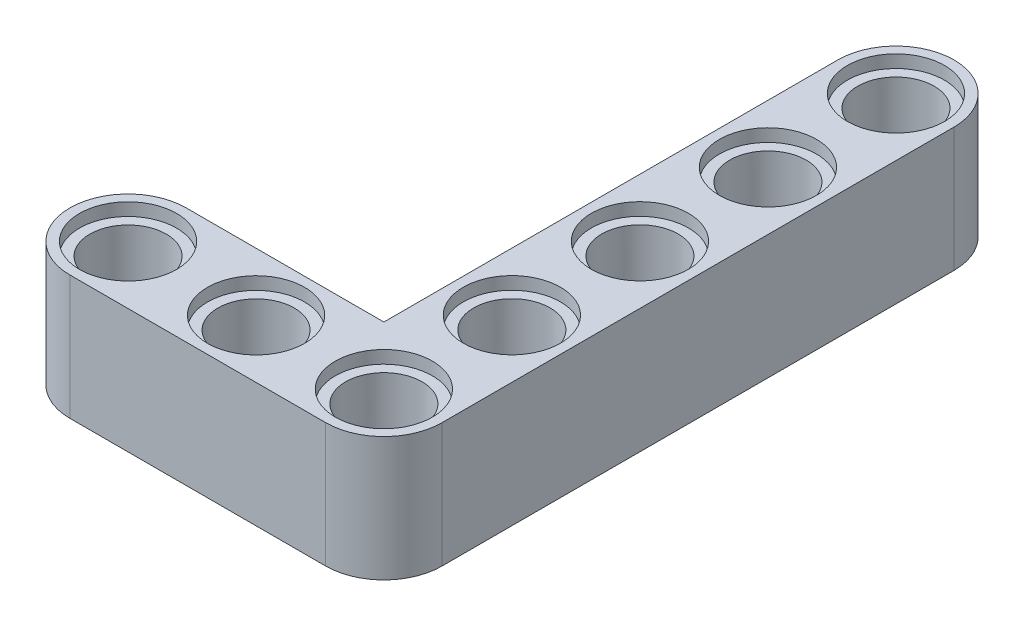
ISO-10303-21;
HEADER;
FILE_DESCRIPTION(('STEP AP214'),'2;1');
FILE_NAME('part.step','',(''),(''),'','','');
FILE_SCHEMA(('AUTOMOTIVE_DESIGN { 1 0 10303 214 1 1 1 1 }'));
ENDSEC;
DATA;
#1=APPLICATION_CONTEXT('core data for automotive mechanical design processes');
#2=APPLICATION_PROTOCOL_DEFINITION('international standard','automotive_design',2000,#1);
#3=PRODUCT_CONTEXT('',#1,'mechanical');
#4=PRODUCT('Part','Part','',(#3));
#5=PRODUCT_RELATED_PRODUCT_CATEGORY('part','',(#4));
#6=PRODUCT_DEFINITION_FORMATION('','',#4);
#7=PRODUCT_DEFINITION_CONTEXT('part definition',#1,'design');
#8=PRODUCT_DEFINITION('design','',#6,#7);
#9=PRODUCT_DEFINITION_SHAPE('','',#8);
#10=(LENGTH_UNIT() NAMED_UNIT(*) SI_UNIT(.MILLI.,.METRE.));
#11=(NAMED_UNIT(*) PLANE_ANGLE_UNIT() SI_UNIT($,.RADIAN.));
#12=(NAMED_UNIT(*) SI_UNIT($,.STERADIAN.) SOLID_ANGLE_UNIT());
#13=UNCERTAINTY_MEASURE_WITH_UNIT(LENGTH_MEASURE(1.E-05),#10,'distance_accuracy_value','');
#14=(GEOMETRIC_REPRESENTATION_CONTEXT(3) GLOBAL_UNCERTAINTY_ASSIGNED_CONTEXT((#13)) GLOBAL_UNIT_ASSIGNED_CONTEXT((#10,
#11,#12)) REPRESENTATION_CONTEXT('',''));
#15=CARTESIAN_POINT('',(0.,0.,0.));
#16=DIRECTION('',(0.,0.,1.));
#17=DIRECTION('',(1.,0.,0.));
#18=AXIS2_PLACEMENT_3D('',#15,#16,#17);
#19=CARTESIAN_POINT('',(-39.0124274848828,7.8,18.5405550831444));
#20=DIRECTION('',(0.,-1.,0.));
#21=DIRECTION('',(0.,0.,-1.));
#22=AXIS2_PLACEMENT_3D('',#19,#20,#21);
#23=CYLINDRICAL_SURFACE('',#22,2.4);
#24=CARTESIAN_POINT('',(-39.0124274848828,7.,18.5405550831444));
#25=DIRECTION('',(0.,1.,0.));
#26=DIRECTION('',(0.,0.,1.));
#27=AXIS2_PLACEMENT_3D('',#24,#25,#26);
#28=CIRCLE('',#27,2.4);
#29=CARTESIAN_POINT('',(-39.0124274848828,7.,20.9405550831444));
#30=VERTEX_POINT('',#29);
#31=EDGE_CURVE('E130',#30,#30,#28,.T.);
#32=ORIENTED_EDGE('',*,*,#31,.T.);
#33=EDGE_LOOP('',(#32));
#34=FACE_BOUND('',#33,.T.);
#35=CARTESIAN_POINT('',(-39.0124274848828,0.8,18.5405550831444));
#36=DIRECTION('',(0.,-1.,0.));
#37=DIRECTION('',(0.,0.,-1.));
#38=AXIS2_PLACEMENT_3D('',#35,#36,#37);
#39=CIRCLE('',#38,2.4);
#40=CARTESIAN_POINT('',(-39.0124274848828,0.8,16.1405550831444));
#41=VERTEX_POINT('',#40);
#42=EDGE_CURVE('E37',#41,#41,#39,.T.);
#43=ORIENTED_EDGE('',*,*,#42,.T.);
#44=EDGE_LOOP('',(#43));
#45=FACE_BOUND('',#44,.T.);
#46=ADVANCED_FACE('F33',(#34,#45),#23,.F.);
#47=CARTESIAN_POINT('',(-30.9724274848828,7.8,18.5405550831444));
#48=DIRECTION('',(0.,-1.,0.));
#49=DIRECTION('',(0.,0.,-1.));
#50=AXIS2_PLACEMENT_3D('',#47,#48,#49);
#51=CYLINDRICAL_SURFACE('',#50,2.4);
#52=CARTESIAN_POINT('',(-30.9724274848828,7.,18.5405550831444));
#53=DIRECTION('',(0.,1.,0.));
#54=DIRECTION('',(0.,0.,1.));
#55=AXIS2_PLACEMENT_3D('',#52,#53,#54);
#56=CIRCLE('',#55,2.4);
#57=CARTESIAN_POINT('',(-30.9724274848828,7.,20.9405550831444));
#58=VERTEX_POINT('',#57);
#59=EDGE_CURVE('E164',#58,#58,#56,.T.);
#60=ORIENTED_EDGE('',*,*,#59,.T.);
#61=EDGE_LOOP('',(#60));
#62=FACE_BOUND('',#61,.T.);
#63=CARTESIAN_POINT('',(-30.9724274848828,0.8,18.5405550831444));
#64=DIRECTION('',(0.,-1.,0.));
#65=DIRECTION('',(0.,0.,-1.));
#66=AXIS2_PLACEMENT_3D('',#63,#64,#65);
#67=CIRCLE('',#66,2.4);
#68=CARTESIAN_POINT('',(-30.9724274848828,0.8,16.1405550831444));
#69=VERTEX_POINT('',#68);
#70=EDGE_CURVE('E184',#69,#69,#67,.T.);
#71=ORIENTED_EDGE('',*,*,#70,.T.);
#72=EDGE_LOOP('',(#71));
#73=FACE_BOUND('',#72,.T.);
#74=ADVANCED_FACE('F233',(#62,#73),#51,.F.);
#75=CARTESIAN_POINT('',(-22.9464753406226,7.8,18.5405550831444));
#76=DIRECTION('',(0.,-1.,0.));
#77=DIRECTION('',(0.,0.,-1.));
#78=AXIS2_PLACEMENT_3D('',#75,#76,#77);
#79=CYLINDRICAL_SURFACE('',#78,2.4);
#80=CARTESIAN_POINT('',(-22.9464753406226,7.,18.5405550831444));
#81=DIRECTION('',(0.,1.,0.));
#82=DIRECTION('',(0.,0.,1.));
#83=AXIS2_PLACEMENT_3D('',#80,#81,#82);
#84=CIRCLE('',#83,2.4);
#85=CARTESIAN_POINT('',(-22.9464753406226,7.,20.9405550831444));
#86=VERTEX_POINT('',#85);
#87=EDGE_CURVE('E161',#86,#86,#84,.T.);
#88=ORIENTED_EDGE('',*,*,#87,.T.);
#89=EDGE_LOOP('',(#88));
#90=FACE_BOUND('',#89,.T.);
#91=CARTESIAN_POINT('',(-22.9464753406226,0.8,18.5405550831444));
#92=DIRECTION('',(0.,-1.,0.));
#93=DIRECTION('',(0.,0.,-1.));
#94=AXIS2_PLACEMENT_3D('',#91,#92,#93);
#95=CIRCLE('',#94,2.4);
#96=CARTESIAN_POINT('',(-22.9464753406226,0.8,16.1405550831444));
#97=VERTEX_POINT('',#96);
#98=EDGE_CURVE('E182',#97,#97,#95,.T.);
#99=ORIENTED_EDGE('',*,*,#98,.T.);
#100=EDGE_LOOP('',(#99));
#101=FACE_BOUND('',#100,.T.);
#102=ADVANCED_FACE('F239',(#90,#101),#79,.F.);
#103=CARTESIAN_POINT('',(-22.9464753406226,7.8,-5.57944491685563));
#104=DIRECTION('',(0.,-1.,0.));
#105=DIRECTION('',(0.,0.,-1.));
#106=AXIS2_PLACEMENT_3D('',#103,#104,#105);
#107=CYLINDRICAL_SURFACE('',#106,2.4);
#108=CARTESIAN_POINT('',(-22.9464753406226,7.,-5.57944491685563));
#109=DIRECTION('',(0.,1.,0.));
#110=DIRECTION('',(0.,0.,1.));
#111=AXIS2_PLACEMENT_3D('',#108,#109,#110);
#112=CIRCLE('',#111,2.4);
#113=CARTESIAN_POINT('',(-22.9464753406226,7.,-3.17944491685563));
#114=VERTEX_POINT('',#113);
#115=EDGE_CURVE('E158',#114,#114,#112,.T.);
#116=ORIENTED_EDGE('',*,*,#115,.T.);
#117=EDGE_LOOP('',(#116));
#118=FACE_BOUND('',#117,.T.);
#119=CARTESIAN_POINT('',(-22.9464753406226,0.8,-5.57944491685563));
#120=DIRECTION('',(0.,-1.,0.));
#121=DIRECTION('',(0.,0.,-1.));
#122=AXIS2_PLACEMENT_3D('',#119,#120,#121);
#123=CIRCLE('',#122,2.4);
#124=CARTESIAN_POINT('',(-22.9464753406226,0.8,-7.97944491685563));
#125=VERTEX_POINT('',#124);
#126=EDGE_CURVE('E179',#125,#125,#123,.T.);
#127=ORIENTED_EDGE('',*,*,#126,.T.);
#128=EDGE_LOOP('',(#127));
#129=FACE_BOUND('',#128,.T.);
#130=ADVANCED_FACE('F362',(#118,#129),#107,.F.);
#131=CARTESIAN_POINT('',(-22.9464753406226,7.8,2.46055508314437));
#132=DIRECTION('',(0.,-1.,0.));
#133=DIRECTION('',(0.,0.,-1.));
#134=AXIS2_PLACEMENT_3D('',#131,#132,#133);
#135=CYLINDRICAL_SURFACE('',#134,2.4);
#136=CARTESIAN_POINT('',(-22.9464753406226,7.,2.46055508314437));
#137=DIRECTION('',(0.,1.,0.));
#138=DIRECTION('',(0.,0.,1.));
#139=AXIS2_PLACEMENT_3D('',#136,#137,#138);
#140=CIRCLE('',#139,2.4);
#141=CARTESIAN_POINT('',(-22.9464753406226,7.,4.86055508314437));
#142=VERTEX_POINT('',#141);
#143=EDGE_CURVE('E155',#142,#142,#140,.T.);
#144=ORIENTED_EDGE('',*,*,#143,.T.);
#145=EDGE_LOOP('',(#144));
#146=FACE_BOUND('',#145,.T.);
#147=CARTESIAN_POINT('',(-22.9464753406226,0.8,2.46055508314437));
#148=DIRECTION('',(0.,-1.,0.));
#149=DIRECTION('',(0.,0.,-1.));
#150=AXIS2_PLACEMENT_3D('',#147,#148,#149);
#151=CIRCLE('',#150,2.4);
#152=CARTESIAN_POINT('',(-22.9464753406226,0.8,0.0605550831443689));
#153=VERTEX_POINT('',#152);
#154=EDGE_CURVE('E176',#153,#153,#151,.T.);
#155=ORIENTED_EDGE('',*,*,#154,.T.);
#156=EDGE_LOOP('',(#155));
#157=FACE_BOUND('',#156,.T.);
#158=ADVANCED_FACE('F358',(#146,#157),#135,.F.);
#159=CARTESIAN_POINT('',(-22.9464753406226,7.8,-13.6194449168556));
#160=DIRECTION('',(0.,-1.,0.));
#161=DIRECTION('',(0.,0.,-1.));
#162=AXIS2_PLACEMENT_3D('',#159,#160,#161);
#163=CYLINDRICAL_SURFACE('',#162,2.4);
#164=CARTESIAN_POINT('',(-22.9464753406226,7.,-13.6194449168556));
#165=DIRECTION('',(0.,1.,0.));
#166=DIRECTION('',(0.,0.,1.));
#167=AXIS2_PLACEMENT_3D('',#164,#165,#166);
#168=CIRCLE('',#167,2.4);
#169=CARTESIAN_POINT('',(-22.9464753406226,7.,-11.2194449168556));
#170=VERTEX_POINT('',#169);
#171=EDGE_CURVE('E151',#170,#170,#168,.T.);
#172=ORIENTED_EDGE('',*,*,#171,.T.);
#173=EDGE_LOOP('',(#172));
#174=FACE_BOUND('',#173,.T.);
#175=CARTESIAN_POINT('',(-22.9464753406226,0.8,-13.6194449168556));
#176=DIRECTION('',(0.,-1.,0.));
#177=DIRECTION('',(0.,0.,-1.));
#178=AXIS2_PLACEMENT_3D('',#175,#176,#177);
#179=CIRCLE('',#178,2.4);
#180=CARTESIAN_POINT('',(-22.9464753406226,0.8,-16.0194449168556));
#181=VERTEX_POINT('',#180);
#182=EDGE_CURVE('E172',#181,#181,#179,.T.);
#183=ORIENTED_EDGE('',*,*,#182,.T.);
#184=EDGE_LOOP('',(#183));
#185=FACE_BOUND('',#184,.T.);
#186=ADVANCED_FACE('F354',(#174,#185),#163,.F.);
#187=CARTESIAN_POINT('',(-22.9464753406226,7.8,10.5005550831444));
#188=DIRECTION('',(0.,-1.,0.));
#189=DIRECTION('',(0.,0.,-1.));
#190=AXIS2_PLACEMENT_3D('',#187,#188,#189);
#191=CYLINDRICAL_SURFACE('',#190,2.4);
#192=CARTESIAN_POINT('',(-22.9464753406226,7.,10.5005550831444));
#193=DIRECTION('',(0.,1.,0.));
#194=DIRECTION('',(0.,0.,1.));
#195=AXIS2_PLACEMENT_3D('',#192,#193,#194);
#196=CIRCLE('',#195,2.4);
#197=CARTESIAN_POINT('',(-22.9464753406226,7.,12.9005550831444));
#198=VERTEX_POINT('',#197);
#199=EDGE_CURVE('E148',#198,#198,#196,.T.);
#200=ORIENTED_EDGE('',*,*,#199,.T.);
#201=EDGE_LOOP('',(#200));
#202=FACE_BOUND('',#201,.T.);
#203=CARTESIAN_POINT('',(-22.9464753406226,0.8,10.5005550831444));
#204=DIRECTION('',(0.,-1.,0.));
#205=DIRECTION('',(0.,0.,-1.));
#206=AXIS2_PLACEMENT_3D('',#203,#204,#205);
#207=CIRCLE('',#206,2.4);
#208=CARTESIAN_POINT('',(-22.9464753406226,0.8,8.10055508314437));
#209=VERTEX_POINT('',#208);
#210=EDGE_CURVE('E169',#209,#209,#207,.T.);
#211=ORIENTED_EDGE('',*,*,#210,.T.);
#212=EDGE_LOOP('',(#211));
#213=FACE_BOUND('',#212,.T.);
#214=ADVANCED_FACE('F245',(#202,#213),#191,.F.);
#215=CARTESIAN_POINT('',(-39.0124274848828,7.8,18.5405550831444));
#216=DIRECTION('',(0.,1.,0.));
#217=DIRECTION('',(0.,0.,1.));
#218=AXIS2_PLACEMENT_3D('',#215,#216,#217);
#219=PLANE('',#218);
#220=CARTESIAN_POINT('',(-39.0124274848828,7.8,18.5405550831444));
#221=DIRECTION('',(0.,1.,0.));
#222=DIRECTION('',(0.,0.,1.));
#223=AXIS2_PLACEMENT_3D('',#220,#221,#222);
#224=CIRCLE('',#223,3.05);
#225=CARTESIAN_POINT('',(-39.0124274848828,7.8,21.5905550831444));
#226=VERTEX_POINT('',#225);
#227=EDGE_CURVE('E291',#226,#226,#224,.T.);
#228=ORIENTED_EDGE('',*,*,#227,.F.);
#229=EDGE_LOOP('',(#228));
#230=FACE_BOUND('',#229,.T.);
#231=CARTESIAN_POINT('',(-30.9724274848828,7.8,18.5405550831444));
#232=DIRECTION('',(0.,1.,0.));
#233=DIRECTION('',(0.,0.,1.));
#234=AXIS2_PLACEMENT_3D('',#231,#232,#233);
#235=CIRCLE('',#234,3.05);
#236=CARTESIAN_POINT('',(-30.9724274848828,7.8,21.5905550831444));
#237=VERTEX_POINT('',#236);
#238=EDGE_CURVE('E297',#237,#237,#235,.T.);
#239=ORIENTED_EDGE('',*,*,#238,.F.);
#240=EDGE_LOOP('',(#239));
#241=FACE_BOUND('',#240,.T.);
#242=CARTESIAN_POINT('',(-22.9464753406226,7.8,18.5405550831444));
#243=DIRECTION('',(0.,1.,0.));
#244=DIRECTION('',(0.,0.,1.));
#245=AXIS2_PLACEMENT_3D('',#242,#243,#244);
#246=CIRCLE('',#245,3.05);
#247=CARTESIAN_POINT('',(-22.9464753406226,7.8,21.5905550831444));
#248=VERTEX_POINT('',#247);
#249=EDGE_CURVE('E303',#248,#248,#246,.T.);
#250=ORIENTED_EDGE('',*,*,#249,.F.);
#251=EDGE_LOOP('',(#250));
#252=FACE_BOUND('',#251,.T.);
#253=CARTESIAN_POINT('',(-22.9464753406226,7.8,10.5005550831444));
#254=DIRECTION('',(0.,1.,0.));
#255=DIRECTION('',(0.,0.,1.));
#256=AXIS2_PLACEMENT_3D('',#253,#254,#255);
#257=CIRCLE('',#256,3.05);
#258=CARTESIAN_POINT('',(-22.9464753406226,7.8,13.5505550831444));
#259=VERTEX_POINT('',#258);
#260=EDGE_CURVE('E309',#259,#259,#257,.T.);
#261=ORIENTED_EDGE('',*,*,#260,.F.);
#262=EDGE_LOOP('',(#261));
#263=FACE_BOUND('',#262,.T.);
#264=CARTESIAN_POINT('',(-22.9464753406226,7.8,2.46055508314437));
#265=DIRECTION('',(0.,1.,0.));
#266=DIRECTION('',(0.,0.,1.));
#267=AXIS2_PLACEMENT_3D('',#264,#265,#266);
#268=CIRCLE('',#267,3.05);
#269=CARTESIAN_POINT('',(-22.9464753406226,7.8,5.51055508314437));
#270=VERTEX_POINT('',#269);
#271=EDGE_CURVE('E315',#270,#270,#268,.T.);
#272=ORIENTED_EDGE('',*,*,#271,.F.);
#273=EDGE_LOOP('',(#272));
#274=FACE_BOUND('',#273,.T.);
#275=CARTESIAN_POINT('',(-22.9464753406226,7.8,-5.57944491685563));
#276=DIRECTION('',(0.,1.,0.));
#277=DIRECTION('',(0.,0.,1.));
#278=AXIS2_PLACEMENT_3D('',#275,#276,#277);
#279=CIRCLE('',#278,3.05);
#280=CARTESIAN_POINT('',(-22.9464753406226,7.8,-2.52944491685563));
#281=VERTEX_POINT('',#280);
#282=EDGE_CURVE('E198',#281,#281,#279,.T.);
#283=ORIENTED_EDGE('',*,*,#282,.F.);
#284=EDGE_LOOP('',(#283));
#285=FACE_BOUND('',#284,.T.);
#286=CARTESIAN_POINT('',(-22.9464753406226,7.8,-13.6194449168556));
#287=DIRECTION('',(0.,1.,0.));
#288=DIRECTION('',(0.,0.,1.));
#289=AXIS2_PLACEMENT_3D('',#286,#287,#288);
#290=CIRCLE('',#289,3.05);
#291=CARTESIAN_POINT('',(-22.9464753406226,7.8,-10.5694449168556));
#292=VERTEX_POINT('',#291);
#293=EDGE_CURVE('E189',#292,#292,#290,.T.);
#294=ORIENTED_EDGE('',*,*,#293,.F.);
#295=EDGE_LOOP('',(#294));
#296=FACE_BOUND('',#295,.T.);
#297=CARTESIAN_POINT('',(-39.0124274848828,7.8,18.5405550831444));
#298=DIRECTION('',(0.,1.,0.));
#299=DIRECTION('',(0.,0.,1.));
#300=AXIS2_PLACEMENT_3D('',#297,#298,#299);
#301=CIRCLE('',#300,3.65);
#302=CARTESIAN_POINT('',(-39.0124274848828,7.8,14.8905550831444));
#303=VERTEX_POINT('',#302);
#304=CARTESIAN_POINT('',(-39.0124274848828,7.8,22.1905550831444));
#305=VERTEX_POINT('',#304);
#306=EDGE_CURVE('E139',#303,#305,#301,.T.);
#307=ORIENTED_EDGE('',*,*,#306,.T.);
#308=DIRECTION('',(1.,0.,0.));
#309=VECTOR('',#308,1.);
#310=CARTESIAN_POINT('',(-39.0124274848828,7.8,22.1905550831444));
#311=LINE('',#310,#309);
#312=CARTESIAN_POINT('',(-22.9464753406226,7.8,22.1905550831444));
#313=VERTEX_POINT('',#312);
#314=EDGE_CURVE('E92',#305,#313,#311,.T.);
#315=ORIENTED_EDGE('',*,*,#314,.T.);
#316=CARTESIAN_POINT('',(-22.9464753406226,7.8,18.5405550831444));
#317=DIRECTION('',(0.,1.,0.));
#318=DIRECTION('',(0.,0.,1.));
#319=AXIS2_PLACEMENT_3D('',#316,#317,#318);
#320=CIRCLE('',#319,3.65);
#321=CARTESIAN_POINT('',(-19.2964753406226,7.8,18.5405550831444));
#322=VERTEX_POINT('',#321);
#323=EDGE_CURVE('E204',#313,#322,#320,.T.);
#324=ORIENTED_EDGE('',*,*,#323,.T.);
#325=DIRECTION('',(-2.92690625139714E-08,0.,-1.));
#326=VECTOR('',#325,1.);
#327=CARTESIAN_POINT('',(-19.2964753406226,7.8,18.5405550831444));
#328=LINE('',#327,#326);
#329=CARTESIAN_POINT('',(-19.2964762819156,7.8,-13.6194449168556));
#330=VERTEX_POINT('',#329);
#331=EDGE_CURVE('E108',#322,#330,#328,.T.);
#332=ORIENTED_EDGE('',*,*,#331,.T.);
#333=CARTESIAN_POINT('',(-22.9464753406226,7.8,-13.6194449168556));
#334=DIRECTION('',(0.,1.,0.));
#335=DIRECTION('',(0.,0.,1.));
#336=AXIS2_PLACEMENT_3D('',#333,#334,#335);
#337=CIRCLE('',#336,3.64999905870695);
#338=CARTESIAN_POINT('',(-26.5964743993295,7.8,-13.6194449168556));
#339=VERTEX_POINT('',#338);
#340=EDGE_CURVE('E102',#330,#339,#337,.T.);
#341=ORIENTED_EDGE('',*,*,#340,.T.);
#342=DIRECTION('',(2.92690625314332E-08,0.,1.));
#343=VECTOR('',#342,1.);
#344=CARTESIAN_POINT('',(-26.5964735648685,7.8,14.890554719741));
#345=LINE('',#344,#343);
#346=CARTESIAN_POINT('',(-26.5964735648685,7.8,14.890554719741));
#347=VERTEX_POINT('',#346);
#348=EDGE_CURVE('E106',#339,#347,#345,.T.);
#349=ORIENTED_EDGE('',*,*,#348,.T.);
#350=DIRECTION('',(-1.,0.,2.92690625362702E-08));
#351=VECTOR('',#350,1.);
#352=CARTESIAN_POINT('',(-39.0124274848828,7.8,14.8905550831444));
#353=LINE('',#352,#351);
#354=EDGE_CURVE('E52',#347,#303,#353,.T.);
#355=ORIENTED_EDGE('',*,*,#354,.T.);
#356=EDGE_LOOP('',(#307,#315,#324,#332,#341,#349,#355));
#357=FACE_BOUND('',#356,.T.);
#358=ADVANCED_FACE('F104',(#230,#241,#252,#263,#274,#285,#296,#357),#219,.T.);
#359=CARTESIAN_POINT('',(-39.0124274848828,0.,18.5405550831444));
#360=DIRECTION('',(0.,1.,0.));
#361=DIRECTION('',(0.,0.,1.));
#362=AXIS2_PLACEMENT_3D('',#359,#360,#361);
#363=PLANE('',#362);
#364=CARTESIAN_POINT('',(-22.9464753406226,0.,-13.6194449168556));
#365=DIRECTION('',(0.,-1.,0.));
#366=DIRECTION('',(0.,0.,-1.));
#367=AXIS2_PLACEMENT_3D('',#364,#365,#366);
#368=CIRCLE('',#367,3.05);
#369=CARTESIAN_POINT('',(-22.9464753406226,0.,-16.6694449168556));
#370=VERTEX_POINT('',#369);
#371=EDGE_CURVE('E256',#370,#370,#368,.T.);
#372=ORIENTED_EDGE('',*,*,#371,.F.);
#373=EDGE_LOOP('',(#372));
#374=FACE_BOUND('',#373,.T.);
#375=CARTESIAN_POINT('',(-22.9464753406226,0.,-5.57944491685563));
#376=DIRECTION('',(0.,-1.,0.));
#377=DIRECTION('',(0.,0.,-1.));
#378=AXIS2_PLACEMENT_3D('',#375,#376,#377);
#379=CIRCLE('',#378,3.05);
#380=CARTESIAN_POINT('',(-22.9464753406226,0.,-8.62944491685563));
#381=VERTEX_POINT('',#380);
#382=EDGE_CURVE('E260',#381,#381,#379,.T.);
#383=ORIENTED_EDGE('',*,*,#382,.F.);
#384=EDGE_LOOP('',(#383));
#385=FACE_BOUND('',#384,.T.);
#386=CARTESIAN_POINT('',(-22.9464753406226,0.,2.46055508314437));
#387=DIRECTION('',(0.,-1.,0.));
#388=DIRECTION('',(0.,0.,-1.));
#389=AXIS2_PLACEMENT_3D('',#386,#387,#388);
#390=CIRCLE('',#389,3.05);
#391=CARTESIAN_POINT('',(-22.9464753406226,0.,-0.589444916855632));
#392=VERTEX_POINT('',#391);
#393=EDGE_CURVE('E264',#392,#392,#390,.T.);
#394=ORIENTED_EDGE('',*,*,#393,.F.);
#395=EDGE_LOOP('',(#394));
#396=FACE_BOUND('',#395,.T.);
#397=CARTESIAN_POINT('',(-22.9464753406226,0.,10.5005550831444));
#398=DIRECTION('',(0.,-1.,0.));
#399=DIRECTION('',(0.,0.,-1.));
#400=AXIS2_PLACEMENT_3D('',#397,#398,#399);
#401=CIRCLE('',#400,3.05);
#402=CARTESIAN_POINT('',(-22.9464753406226,0.,7.45055508314437));
#403=VERTEX_POINT('',#402);
#404=EDGE_CURVE('E268',#403,#403,#401,.T.);
#405=ORIENTED_EDGE('',*,*,#404,.F.);
#406=EDGE_LOOP('',(#405));
#407=FACE_BOUND('',#406,.T.);
#408=CARTESIAN_POINT('',(-22.9464753406226,0.,18.5405550831444));
#409=DIRECTION('',(0.,-1.,0.));
#410=DIRECTION('',(0.,0.,-1.));
#411=AXIS2_PLACEMENT_3D('',#408,#409,#410);
#412=CIRCLE('',#411,3.05);
#413=CARTESIAN_POINT('',(-22.9464753406226,0.,15.4905550831444));
#414=VERTEX_POINT('',#413);
#415=EDGE_CURVE('E272',#414,#414,#412,.T.);
#416=ORIENTED_EDGE('',*,*,#415,.F.);
#417=EDGE_LOOP('',(#416));
#418=FACE_BOUND('',#417,.T.);
#419=CARTESIAN_POINT('',(-39.0124274848828,0.,18.5405550831444));
#420=DIRECTION('',(0.,-1.,0.));
#421=DIRECTION('',(0.,0.,-1.));
#422=AXIS2_PLACEMENT_3D('',#419,#420,#421);
#423=CIRCLE('',#422,3.05);
#424=CARTESIAN_POINT('',(-39.0124274848828,0.,15.4905550831444));
#425=VERTEX_POINT('',#424);
#426=EDGE_CURVE('E276',#425,#425,#423,.T.);
#427=ORIENTED_EDGE('',*,*,#426,.F.);
#428=EDGE_LOOP('',(#427));
#429=FACE_BOUND('',#428,.T.);
#430=CARTESIAN_POINT('',(-30.9724274848828,0.,18.5405550831444));
#431=DIRECTION('',(0.,-1.,0.));
#432=DIRECTION('',(0.,0.,-1.));
#433=AXIS2_PLACEMENT_3D('',#430,#431,#432);
#434=CIRCLE('',#433,3.05);
#435=CARTESIAN_POINT('',(-30.9724274848828,0.,15.4905550831444));
#436=VERTEX_POINT('',#435);
#437=EDGE_CURVE('E279',#436,#436,#434,.T.);
#438=ORIENTED_EDGE('',*,*,#437,.F.);
#439=EDGE_LOOP('',(#438));
#440=FACE_BOUND('',#439,.T.);
#441=CARTESIAN_POINT('',(-39.0124274848828,0.,18.5405550831444));
#442=DIRECTION('',(0.,1.,0.));
#443=DIRECTION('',(0.,0.,1.));
#444=AXIS2_PLACEMENT_3D('',#441,#442,#443);
#445=CIRCLE('',#444,3.65);
#446=CARTESIAN_POINT('',(-39.0124274848828,0.,14.8905550831444));
#447=VERTEX_POINT('',#446);
#448=CARTESIAN_POINT('',(-39.0124274848828,0.,22.1905550831444));
#449=VERTEX_POINT('',#448);
#450=EDGE_CURVE('E126',#447,#449,#445,.T.);
#451=ORIENTED_EDGE('',*,*,#450,.F.);
#452=DIRECTION('',(-1.,0.,2.92690625362702E-08));
#453=VECTOR('',#452,1.);
#454=CARTESIAN_POINT('',(-39.0124274848828,0.,14.8905550831444));
#455=LINE('',#454,#453);
#456=CARTESIAN_POINT('',(-26.5964735648685,0.,14.890554719741));
#457=VERTEX_POINT('',#456);
#458=EDGE_CURVE('E84',#457,#447,#455,.T.);
#459=ORIENTED_EDGE('',*,*,#458,.F.);
#460=DIRECTION('',(2.92690625314332E-08,0.,1.));
#461=VECTOR('',#460,1.);
#462=CARTESIAN_POINT('',(-26.5964735648685,0.,14.890554719741));
#463=LINE('',#462,#461);
#464=CARTESIAN_POINT('',(-26.5964743993295,0.,-13.6194449168556));
#465=VERTEX_POINT('',#464);
#466=EDGE_CURVE('E78',#465,#457,#463,.T.);
#467=ORIENTED_EDGE('',*,*,#466,.F.);
#468=CARTESIAN_POINT('',(-22.9464753406226,0.,-13.6194449168556));
#469=DIRECTION('',(0.,1.,0.));
#470=DIRECTION('',(0.,0.,1.));
#471=AXIS2_PLACEMENT_3D('',#468,#469,#470);
#472=CIRCLE('',#471,3.64999905870695);
#473=CARTESIAN_POINT('',(-19.2964762819156,0.,-13.6194449168556));
#474=VERTEX_POINT('',#473);
#475=EDGE_CURVE('E116',#474,#465,#472,.T.);
#476=ORIENTED_EDGE('',*,*,#475,.F.);
#477=DIRECTION('',(-2.92690625139714E-08,0.,-1.));
#478=VECTOR('',#477,1.);
#479=CARTESIAN_POINT('',(-19.2964753406226,0.,18.5405550831444));
#480=LINE('',#479,#478);
#481=CARTESIAN_POINT('',(-19.2964753406226,0.,18.5405550831444));
#482=VERTEX_POINT('',#481);
#483=EDGE_CURVE('E134',#482,#474,#480,.T.);
#484=ORIENTED_EDGE('',*,*,#483,.F.);
#485=CARTESIAN_POINT('',(-22.9464753406226,0.,18.5405550831444));
#486=DIRECTION('',(0.,1.,0.));
#487=DIRECTION('',(0.,0.,1.));
#488=AXIS2_PLACEMENT_3D('',#485,#486,#487);
#489=CIRCLE('',#488,3.65);
#490=CARTESIAN_POINT('',(-22.9464753406226,0.,22.1905550831444));
#491=VERTEX_POINT('',#490);
#492=EDGE_CURVE('E132',#491,#482,#489,.T.);
#493=ORIENTED_EDGE('',*,*,#492,.F.);
#494=DIRECTION('',(1.,0.,0.));
#495=VECTOR('',#494,1.);
#496=CARTESIAN_POINT('',(-39.0124274848828,0.,22.1905550831444));
#497=LINE('',#496,#495);
#498=EDGE_CURVE('E129',#449,#491,#497,.T.);
#499=ORIENTED_EDGE('',*,*,#498,.F.);
#500=EDGE_LOOP('',(#451,#459,#467,#476,#484,#493,#499));
#501=FACE_BOUND('',#500,.T.);
#502=ADVANCED_FACE('F215',(#374,#385,#396,#407,#418,#429,#440,#501),#363,.F.);
#503=CARTESIAN_POINT('',(-39.0124274848828,7.8,18.5405550831444));
#504=DIRECTION('',(0.,-1.,0.));
#505=DIRECTION('',(0.,0.,-1.));
#506=AXIS2_PLACEMENT_3D('',#503,#504,#505);
#507=CYLINDRICAL_SURFACE('',#506,3.65);
#508=ORIENTED_EDGE('',*,*,#450,.T.);
#509=DIRECTION('',(0.,-1.,0.));
#510=VECTOR('',#509,1.);
#511=CARTESIAN_POINT('',(-39.0124274848828,7.8,22.1905550831444));
#512=LINE('',#511,#510);
#513=EDGE_CURVE('E11',#305,#449,#512,.T.);
#514=ORIENTED_EDGE('',*,*,#513,.F.);
#515=ORIENTED_EDGE('',*,*,#306,.F.);
#516=DIRECTION('',(0.,-1.,0.));
#517=VECTOR('',#516,1.);
#518=CARTESIAN_POINT('',(-39.0124274848828,7.8,14.8905550831444));
#519=LINE('',#518,#517);
#520=EDGE_CURVE('E122',#303,#447,#519,.T.);
#521=ORIENTED_EDGE('',*,*,#520,.T.);
#522=EDGE_LOOP('',(#508,#514,#515,#521));
#523=FACE_BOUND('',#522,.T.);
#524=ADVANCED_FACE('F35',(#523),#507,.T.);
#525=CARTESIAN_POINT('',(-39.0124274848828,7.8,22.1905550831444));
#526=DIRECTION('',(0.,0.,-1.));
#527=DIRECTION('',(-1.,0.,0.));
#528=AXIS2_PLACEMENT_3D('',#525,#526,#527);
#529=PLANE('',#528);
#530=ORIENTED_EDGE('',*,*,#498,.T.);
#531=DIRECTION('',(0.,-1.,0.));
#532=VECTOR('',#531,1.);
#533=CARTESIAN_POINT('',(-22.9464753406226,7.8,22.1905550831444));
#534=LINE('',#533,#532);
#535=EDGE_CURVE('E43',#313,#491,#534,.T.);
#536=ORIENTED_EDGE('',*,*,#535,.F.);
#537=ORIENTED_EDGE('',*,*,#314,.F.);
#538=ORIENTED_EDGE('',*,*,#513,.T.);
#539=EDGE_LOOP('',(#530,#536,#537,#538));
#540=FACE_BOUND('',#539,.T.);
#541=ADVANCED_FACE('F252',(#540),#529,.F.);
#542=CARTESIAN_POINT('',(-22.9464753406226,7.8,18.5405550831444));
#543=DIRECTION('',(0.,-1.,0.));
#544=DIRECTION('',(0.,0.,-1.));
#545=AXIS2_PLACEMENT_3D('',#542,#543,#544);
#546=CYLINDRICAL_SURFACE('',#545,3.65);
#547=ORIENTED_EDGE('',*,*,#492,.T.);
#548=DIRECTION('',(0.,-1.,0.));
#549=VECTOR('',#548,1.);
#550=CARTESIAN_POINT('',(-19.2964753406226,7.8,18.5405550831444));
#551=LINE('',#550,#549);
#552=EDGE_CURVE('E143',#322,#482,#551,.T.);
#553=ORIENTED_EDGE('',*,*,#552,.F.);
#554=ORIENTED_EDGE('',*,*,#323,.F.);
#555=ORIENTED_EDGE('',*,*,#535,.T.);
#556=EDGE_LOOP('',(#547,#553,#554,#555));
#557=FACE_BOUND('',#556,.T.);
#558=ADVANCED_FACE('F208',(#557),#546,.T.);
#559=CARTESIAN_POINT('',(-19.2964753406226,7.8,18.5405550831444));
#560=DIRECTION('',(-1.,0.,2.92690625139714E-08));
#561=DIRECTION('',(2.92690625139714E-08,0.,1.));
#562=AXIS2_PLACEMENT_3D('',#559,#560,#561);
#563=PLANE('',#562);
#564=ORIENTED_EDGE('',*,*,#483,.T.);
#565=DIRECTION('',(0.,-1.,0.));
#566=VECTOR('',#565,1.);
#567=CARTESIAN_POINT('',(-19.2964762819156,7.8,-13.6194449168556));
#568=LINE('',#567,#566);
#569=EDGE_CURVE('E117',#330,#474,#568,.T.);
#570=ORIENTED_EDGE('',*,*,#569,.F.);
#571=ORIENTED_EDGE('',*,*,#331,.F.);
#572=ORIENTED_EDGE('',*,*,#552,.T.);
#573=EDGE_LOOP('',(#564,#570,#571,#572));
#574=FACE_BOUND('',#573,.T.);
#575=ADVANCED_FACE('F212',(#574),#563,.F.);
#576=CARTESIAN_POINT('',(-22.9464753406226,7.8,-13.6194449168556));
#577=DIRECTION('',(0.,-1.,0.));
#578=DIRECTION('',(0.,0.,-1.));
#579=AXIS2_PLACEMENT_3D('',#576,#577,#578);
#580=CYLINDRICAL_SURFACE('',#579,3.64999905870695);
#581=ORIENTED_EDGE('',*,*,#475,.T.);
#582=DIRECTION('',(0.,-1.,0.));
#583=VECTOR('',#582,1.);
#584=CARTESIAN_POINT('',(-26.5964743993295,7.8,-13.6194449168556));
#585=LINE('',#584,#583);
#586=EDGE_CURVE('E113',#339,#465,#585,.T.);
#587=ORIENTED_EDGE('',*,*,#586,.F.);
#588=ORIENTED_EDGE('',*,*,#340,.F.);
#589=ORIENTED_EDGE('',*,*,#569,.T.);
#590=EDGE_LOOP('',(#581,#587,#588,#589));
#591=FACE_BOUND('',#590,.T.);
#592=ADVANCED_FACE('F114',(#591),#580,.T.);
#593=CARTESIAN_POINT('',(-26.5964735648685,7.8,14.890554719741));
#594=DIRECTION('',(1.,0.,-2.92690625314332E-08));
#595=DIRECTION('',(-2.92690625314332E-08,0.,-1.));
#596=AXIS2_PLACEMENT_3D('',#593,#594,#595);
#597=PLANE('',#596);
#598=ORIENTED_EDGE('',*,*,#466,.T.);
#599=DIRECTION('',(0.,-1.,0.));
#600=VECTOR('',#599,1.);
#601=CARTESIAN_POINT('',(-26.5964735648685,7.8,14.890554719741));
#602=LINE('',#601,#600);
#603=EDGE_CURVE('E118',#347,#457,#602,.T.);
#604=ORIENTED_EDGE('',*,*,#603,.F.);
#605=ORIENTED_EDGE('',*,*,#348,.F.);
#606=ORIENTED_EDGE('',*,*,#586,.T.);
#607=EDGE_LOOP('',(#598,#604,#605,#606));
#608=FACE_BOUND('',#607,.T.);
#609=ADVANCED_FACE('F120',(#608),#597,.F.);
#610=CARTESIAN_POINT('',(-39.0124274848828,7.8,14.8905550831444));
#611=DIRECTION('',(2.92690625362702E-08,0.,1.));
#612=DIRECTION('',(1.,0.,-2.92690625362702E-08));
#613=AXIS2_PLACEMENT_3D('',#610,#611,#612);
#614=PLANE('',#613);
#615=ORIENTED_EDGE('',*,*,#458,.T.);
#616=ORIENTED_EDGE('',*,*,#520,.F.);
#617=ORIENTED_EDGE('',*,*,#354,.F.);
#618=ORIENTED_EDGE('',*,*,#603,.T.);
#619=EDGE_LOOP('',(#615,#616,#617,#618));
#620=FACE_BOUND('',#619,.T.);
#621=ADVANCED_FACE('F219',(#620),#614,.F.);
#622=CARTESIAN_POINT('',(-22.9464753406226,7.,10.5005550831444));
#623=DIRECTION('',(0.,1.,0.));
#624=DIRECTION('',(0.,0.,1.));
#625=AXIS2_PLACEMENT_3D('',#622,#623,#624);
#626=CYLINDRICAL_SURFACE('',#625,3.05);
#627=CARTESIAN_POINT('',(-22.9464753406226,7.,10.5005550831444));
#628=DIRECTION('',(0.,1.,0.));
#629=DIRECTION('',(0.,0.,1.));
#630=AXIS2_PLACEMENT_3D('',#627,#628,#629);
#631=CIRCLE('',#630,3.05);
#632=CARTESIAN_POINT('',(-22.9464753406226,7.,13.5505550831444));
#633=VERTEX_POINT('',#632);
#634=EDGE_CURVE('E306',#633,#633,#631,.T.);
#635=ORIENTED_EDGE('',*,*,#634,.F.);
#636=EDGE_LOOP('',(#635));
#637=FACE_BOUND('',#636,.T.);
#638=ORIENTED_EDGE('',*,*,#260,.T.);
#639=EDGE_LOOP('',(#638));
#640=FACE_BOUND('',#639,.T.);
#641=ADVANCED_FACE('F221',(#637,#640),#626,.F.);
#642=CARTESIAN_POINT('',(-22.9464753406226,7.,10.5005550831444));
#643=DIRECTION('',(0.,1.,0.));
#644=DIRECTION('',(0.,0.,1.));
#645=AXIS2_PLACEMENT_3D('',#642,#643,#644);
#646=PLANE('',#645);
#647=ORIENTED_EDGE('',*,*,#199,.F.);
#648=EDGE_LOOP('',(#647));
#649=FACE_BOUND('',#648,.T.);
#650=ORIENTED_EDGE('',*,*,#634,.T.);
#651=EDGE_LOOP('',(#650));
#652=FACE_BOUND('',#651,.T.);
#653=ADVANCED_FACE('F227',(#649,#652),#646,.T.);
#654=CARTESIAN_POINT('',(-22.9464753406226,7.,-13.6194449168556));
#655=DIRECTION('',(0.,1.,0.));
#656=DIRECTION('',(0.,0.,1.));
#657=AXIS2_PLACEMENT_3D('',#654,#655,#656);
#658=CYLINDRICAL_SURFACE('',#657,3.05);
#659=CARTESIAN_POINT('',(-22.9464753406226,7.,-13.6194449168556));
#660=DIRECTION('',(0.,1.,0.));
#661=DIRECTION('',(0.,0.,1.));
#662=AXIS2_PLACEMENT_3D('',#659,#660,#661);
#663=CIRCLE('',#662,3.05);
#664=CARTESIAN_POINT('',(-22.9464753406226,7.,-10.5694449168556));
#665=VERTEX_POINT('',#664);
#666=EDGE_CURVE('E193',#665,#665,#663,.T.);
#667=ORIENTED_EDGE('',*,*,#666,.F.);
#668=EDGE_LOOP('',(#667));
#669=FACE_BOUND('',#668,.T.);
#670=ORIENTED_EDGE('',*,*,#293,.T.);
#671=EDGE_LOOP('',(#670));
#672=FACE_BOUND('',#671,.T.);
#673=ADVANCED_FACE('F347',(#669,#672),#658,.F.);
#674=CARTESIAN_POINT('',(-22.9464753406226,7.,-13.6194449168556));
#675=DIRECTION('',(0.,1.,0.));
#676=DIRECTION('',(0.,0.,1.));
#677=AXIS2_PLACEMENT_3D('',#674,#675,#676);
#678=PLANE('',#677);
#679=ORIENTED_EDGE('',*,*,#171,.F.);
#680=EDGE_LOOP('',(#679));
#681=FACE_BOUND('',#680,.T.);
#682=ORIENTED_EDGE('',*,*,#666,.T.);
#683=EDGE_LOOP('',(#682));
#684=FACE_BOUND('',#683,.T.);
#685=ADVANCED_FACE('F344',(#681,#684),#678,.T.);
#686=CARTESIAN_POINT('',(-22.9464753406226,7.,2.46055508314437));
#687=DIRECTION('',(0.,1.,0.));
#688=DIRECTION('',(0.,0.,1.));
#689=AXIS2_PLACEMENT_3D('',#686,#687,#688);
#690=CYLINDRICAL_SURFACE('',#689,3.05);
#691=CARTESIAN_POINT('',(-22.9464753406226,7.,2.46055508314437));
#692=DIRECTION('',(0.,1.,0.));
#693=DIRECTION('',(0.,0.,1.));
#694=AXIS2_PLACEMENT_3D('',#691,#692,#693);
#695=CIRCLE('',#694,3.05);
#696=CARTESIAN_POINT('',(-22.9464753406226,7.,5.51055508314437));
#697=VERTEX_POINT('',#696);
#698=EDGE_CURVE('E312',#697,#697,#695,.T.);
#699=ORIENTED_EDGE('',*,*,#698,.F.);
#700=EDGE_LOOP('',(#699));
#701=FACE_BOUND('',#700,.T.);
#702=ORIENTED_EDGE('',*,*,#271,.T.);
#703=EDGE_LOOP('',(#702));
#704=FACE_BOUND('',#703,.T.);
#705=ADVANCED_FACE('F338',(#701,#704),#690,.F.);
#706=CARTESIAN_POINT('',(-22.9464753406226,7.,2.46055508314437));
#707=DIRECTION('',(0.,1.,0.));
#708=DIRECTION('',(0.,0.,1.));
#709=AXIS2_PLACEMENT_3D('',#706,#707,#708);
#710=PLANE('',#709);
#711=ORIENTED_EDGE('',*,*,#143,.F.);
#712=EDGE_LOOP('',(#711));
#713=FACE_BOUND('',#712,.T.);
#714=ORIENTED_EDGE('',*,*,#698,.T.);
#715=EDGE_LOOP('',(#714));
#716=FACE_BOUND('',#715,.T.);
#717=ADVANCED_FACE('F328',(#713,#716),#710,.T.);
#718=CARTESIAN_POINT('',(-22.9464753406226,7.,-5.57944491685563));
#719=DIRECTION('',(0.,1.,0.));
#720=DIRECTION('',(0.,0.,1.));
#721=AXIS2_PLACEMENT_3D('',#718,#719,#720);
#722=CYLINDRICAL_SURFACE('',#721,3.05);
#723=CARTESIAN_POINT('',(-22.9464753406226,7.,-5.57944491685563));
#724=DIRECTION('',(0.,1.,0.));
#725=DIRECTION('',(0.,0.,1.));
#726=AXIS2_PLACEMENT_3D('',#723,#724,#725);
#727=CIRCLE('',#726,3.05);
#728=CARTESIAN_POINT('',(-22.9464753406226,7.,-2.52944491685563));
#729=VERTEX_POINT('',#728);
#730=EDGE_CURVE('E318',#729,#729,#727,.T.);
#731=ORIENTED_EDGE('',*,*,#730,.F.);
#732=EDGE_LOOP('',(#731));
#733=FACE_BOUND('',#732,.T.);
#734=ORIENTED_EDGE('',*,*,#282,.T.);
#735=EDGE_LOOP('',(#734));
#736=FACE_BOUND('',#735,.T.);
#737=ADVANCED_FACE('F323',(#733,#736),#722,.F.);
#738=CARTESIAN_POINT('',(-22.9464753406226,7.,-5.57944491685563));
#739=DIRECTION('',(0.,1.,0.));
#740=DIRECTION('',(0.,0.,1.));
#741=AXIS2_PLACEMENT_3D('',#738,#739,#740);
#742=PLANE('',#741);
#743=ORIENTED_EDGE('',*,*,#115,.F.);
#744=EDGE_LOOP('',(#743));
#745=FACE_BOUND('',#744,.T.);
#746=ORIENTED_EDGE('',*,*,#730,.T.);
#747=EDGE_LOOP('',(#746));
#748=FACE_BOUND('',#747,.T.);
#749=ADVANCED_FACE('F327',(#745,#748),#742,.T.);
#750=CARTESIAN_POINT('',(-22.9464753406226,7.,18.5405550831444));
#751=DIRECTION('',(0.,1.,0.));
#752=DIRECTION('',(0.,0.,1.));
#753=AXIS2_PLACEMENT_3D('',#750,#751,#752);
#754=CYLINDRICAL_SURFACE('',#753,3.05);
#755=CARTESIAN_POINT('',(-22.9464753406226,7.,18.5405550831444));
#756=DIRECTION('',(0.,1.,0.));
#757=DIRECTION('',(0.,0.,1.));
#758=AXIS2_PLACEMENT_3D('',#755,#756,#757);
#759=CIRCLE('',#758,3.05);
#760=CARTESIAN_POINT('',(-22.9464753406226,7.,21.5905550831444));
#761=VERTEX_POINT('',#760);
#762=EDGE_CURVE('E300',#761,#761,#759,.T.);
#763=ORIENTED_EDGE('',*,*,#762,.F.);
#764=EDGE_LOOP('',(#763));
#765=FACE_BOUND('',#764,.T.);
#766=ORIENTED_EDGE('',*,*,#249,.T.);
#767=EDGE_LOOP('',(#766));
#768=FACE_BOUND('',#767,.T.);
#769=ADVANCED_FACE('F335',(#765,#768),#754,.F.);
#770=CARTESIAN_POINT('',(-22.9464753406226,7.,18.5405550831444));
#771=DIRECTION('',(0.,1.,0.));
#772=DIRECTION('',(0.,0.,1.));
#773=AXIS2_PLACEMENT_3D('',#770,#771,#772);
#774=PLANE('',#773);
#775=ORIENTED_EDGE('',*,*,#87,.F.);
#776=EDGE_LOOP('',(#775));
#777=FACE_BOUND('',#776,.T.);
#778=ORIENTED_EDGE('',*,*,#762,.T.);
#779=EDGE_LOOP('',(#778));
#780=FACE_BOUND('',#779,.T.);
#781=ADVANCED_FACE('F445',(#777,#780),#774,.T.);
#782=CARTESIAN_POINT('',(-30.9724274848828,7.,18.5405550831444));
#783=DIRECTION('',(0.,1.,0.));
#784=DIRECTION('',(0.,0.,1.));
#785=AXIS2_PLACEMENT_3D('',#782,#783,#784);
#786=CYLINDRICAL_SURFACE('',#785,3.05);
#787=CARTESIAN_POINT('',(-30.9724274848828,7.,18.5405550831444));
#788=DIRECTION('',(0.,1.,0.));
#789=DIRECTION('',(0.,0.,1.));
#790=AXIS2_PLACEMENT_3D('',#787,#788,#789);
#791=CIRCLE('',#790,3.05);
#792=CARTESIAN_POINT('',(-30.9724274848828,7.,21.5905550831444));
#793=VERTEX_POINT('',#792);
#794=EDGE_CURVE('E294',#793,#793,#791,.T.);
#795=ORIENTED_EDGE('',*,*,#794,.F.);
#796=EDGE_LOOP('',(#795));
#797=FACE_BOUND('',#796,.T.);
#798=ORIENTED_EDGE('',*,*,#238,.T.);
#799=EDGE_LOOP('',(#798));
#800=FACE_BOUND('',#799,.T.);
#801=ADVANCED_FACE('F441',(#797,#800),#786,.F.);
#802=CARTESIAN_POINT('',(-30.9724274848828,7.,18.5405550831444));
#803=DIRECTION('',(0.,1.,0.));
#804=DIRECTION('',(0.,0.,1.));
#805=AXIS2_PLACEMENT_3D('',#802,#803,#804);
#806=PLANE('',#805);
#807=ORIENTED_EDGE('',*,*,#59,.F.);
#808=EDGE_LOOP('',(#807));
#809=FACE_BOUND('',#808,.T.);
#810=ORIENTED_EDGE('',*,*,#794,.T.);
#811=EDGE_LOOP('',(#810));
#812=FACE_BOUND('',#811,.T.);
#813=ADVANCED_FACE('F437',(#809,#812),#806,.T.);
#814=CARTESIAN_POINT('',(-39.0124274848828,7.,18.5405550831444));
#815=DIRECTION('',(0.,1.,0.));
#816=DIRECTION('',(0.,0.,1.));
#817=AXIS2_PLACEMENT_3D('',#814,#815,#816);
#818=CYLINDRICAL_SURFACE('',#817,3.05);
#819=CARTESIAN_POINT('',(-39.0124274848828,7.,18.5405550831444));
#820=DIRECTION('',(0.,1.,0.));
#821=DIRECTION('',(0.,0.,1.));
#822=AXIS2_PLACEMENT_3D('',#819,#820,#821);
#823=CIRCLE('',#822,3.05);
#824=CARTESIAN_POINT('',(-39.0124274848828,7.,21.5905550831444));
#825=VERTEX_POINT('',#824);
#826=EDGE_CURVE('E152',#825,#825,#823,.T.);
#827=ORIENTED_EDGE('',*,*,#826,.F.);
#828=EDGE_LOOP('',(#827));
#829=FACE_BOUND('',#828,.T.);
#830=ORIENTED_EDGE('',*,*,#227,.T.);
#831=EDGE_LOOP('',(#830));
#832=FACE_BOUND('',#831,.T.);
#833=ADVANCED_FACE('F433',(#829,#832),#818,.F.);
#834=CARTESIAN_POINT('',(-39.0124274848828,7.,18.5405550831444));
#835=DIRECTION('',(0.,1.,0.));
#836=DIRECTION('',(0.,0.,1.));
#837=AXIS2_PLACEMENT_3D('',#834,#835,#836);
#838=PLANE('',#837);
#839=ORIENTED_EDGE('',*,*,#31,.F.);
#840=EDGE_LOOP('',(#839));
#841=FACE_BOUND('',#840,.T.);
#842=ORIENTED_EDGE('',*,*,#826,.T.);
#843=EDGE_LOOP('',(#842));
#844=FACE_BOUND('',#843,.T.);
#845=ADVANCED_FACE('F429',(#841,#844),#838,.T.);
#846=CARTESIAN_POINT('',(-30.9724274848828,0.8,18.5405550831444));
#847=DIRECTION('',(0.,-1.,0.));
#848=DIRECTION('',(0.,0.,-1.));
#849=AXIS2_PLACEMENT_3D('',#846,#847,#848);
#850=CYLINDRICAL_SURFACE('',#849,3.05);
#851=CARTESIAN_POINT('',(-30.9724274848828,0.8,18.5405550831444));
#852=DIRECTION('',(0.,-1.,0.));
#853=DIRECTION('',(0.,0.,-1.));
#854=AXIS2_PLACEMENT_3D('',#851,#852,#853);
#855=CIRCLE('',#854,3.05);
#856=CARTESIAN_POINT('',(-30.9724274848828,0.8,15.4905550831444));
#857=VERTEX_POINT('',#856);
#858=EDGE_CURVE('E173',#857,#857,#855,.T.);
#859=ORIENTED_EDGE('',*,*,#858,.F.);
#860=EDGE_LOOP('',(#859));
#861=FACE_BOUND('',#860,.T.);
#862=ORIENTED_EDGE('',*,*,#437,.T.);
#863=EDGE_LOOP('',(#862));
#864=FACE_BOUND('',#863,.T.);
#865=ADVANCED_FACE('F425',(#861,#864),#850,.F.);
#866=CARTESIAN_POINT('',(-30.9724274848828,0.8,18.5405550831444));
#867=DIRECTION('',(0.,-1.,0.));
#868=DIRECTION('',(0.,0.,-1.));
#869=AXIS2_PLACEMENT_3D('',#866,#867,#868);
#870=PLANE('',#869);
#871=ORIENTED_EDGE('',*,*,#70,.F.);
#872=EDGE_LOOP('',(#871));
#873=FACE_BOUND('',#872,.T.);
#874=ORIENTED_EDGE('',*,*,#858,.T.);
#875=EDGE_LOOP('',(#874));
#876=FACE_BOUND('',#875,.T.);
#877=ADVANCED_FACE('F421',(#873,#876),#870,.T.);
#878=CARTESIAN_POINT('',(-39.0124274848828,0.8,18.5405550831444));
#879=DIRECTION('',(0.,-1.,0.));
#880=DIRECTION('',(0.,0.,-1.));
#881=AXIS2_PLACEMENT_3D('',#878,#879,#880);
#882=CYLINDRICAL_SURFACE('',#881,3.05);
#883=CARTESIAN_POINT('',(-39.0124274848828,0.8,18.5405550831444));
#884=DIRECTION('',(0.,-1.,0.));
#885=DIRECTION('',(0.,0.,-1.));
#886=AXIS2_PLACEMENT_3D('',#883,#884,#885);
#887=CIRCLE('',#886,3.05);
#888=CARTESIAN_POINT('',(-39.0124274848828,0.8,15.4905550831444));
#889=VERTEX_POINT('',#888);
#890=EDGE_CURVE('E281',#889,#889,#887,.T.);
#891=ORIENTED_EDGE('',*,*,#890,.F.);
#892=EDGE_LOOP('',(#891));
#893=FACE_BOUND('',#892,.T.);
#894=ORIENTED_EDGE('',*,*,#426,.T.);
#895=EDGE_LOOP('',(#894));
#896=FACE_BOUND('',#895,.T.);
#897=ADVANCED_FACE('F424',(#893,#896),#882,.F.);
#898=CARTESIAN_POINT('',(-39.0124274848828,0.8,18.5405550831444));
#899=DIRECTION('',(0.,-1.,0.));
#900=DIRECTION('',(0.,0.,-1.));
#901=AXIS2_PLACEMENT_3D('',#898,#899,#900);
#902=PLANE('',#901);
#903=ORIENTED_EDGE('',*,*,#42,.F.);
#904=EDGE_LOOP('',(#903));
#905=FACE_BOUND('',#904,.T.);
#906=ORIENTED_EDGE('',*,*,#890,.T.);
#907=EDGE_LOOP('',(#906));
#908=FACE_BOUND('',#907,.T.);
#909=ADVANCED_FACE('F581',(#905,#908),#902,.T.);
#910=CARTESIAN_POINT('',(-22.9464753406226,0.8,18.5405550831444));
#911=DIRECTION('',(0.,-1.,0.));
#912=DIRECTION('',(0.,0.,-1.));
#913=AXIS2_PLACEMENT_3D('',#910,#911,#912);
#914=CYLINDRICAL_SURFACE('',#913,3.05);
#915=CARTESIAN_POINT('',(-22.9464753406226,0.8,18.5405550831444));
#916=DIRECTION('',(0.,-1.,0.));
#917=DIRECTION('',(0.,0.,-1.));
#918=AXIS2_PLACEMENT_3D('',#915,#916,#917);
#919=CIRCLE('',#918,3.05);
#920=CARTESIAN_POINT('',(-22.9464753406226,0.8,15.4905550831444));
#921=VERTEX_POINT('',#920);
#922=EDGE_CURVE('E382',#921,#921,#919,.T.);
#923=ORIENTED_EDGE('',*,*,#922,.F.);
#924=EDGE_LOOP('',(#923));
#925=FACE_BOUND('',#924,.T.);
#926=ORIENTED_EDGE('',*,*,#415,.T.);
#927=EDGE_LOOP('',(#926));
#928=FACE_BOUND('',#927,.T.);
#929=ADVANCED_FACE('F378',(#925,#928),#914,.F.);
#930=CARTESIAN_POINT('',(-22.9464753406226,0.8,18.5405550831444));
#931=DIRECTION('',(0.,-1.,0.));
#932=DIRECTION('',(0.,0.,-1.));
#933=AXIS2_PLACEMENT_3D('',#930,#931,#932);
#934=PLANE('',#933);
#935=ORIENTED_EDGE('',*,*,#98,.F.);
#936=EDGE_LOOP('',(#935));
#937=FACE_BOUND('',#936,.T.);
#938=ORIENTED_EDGE('',*,*,#922,.T.);
#939=EDGE_LOOP('',(#938));
#940=FACE_BOUND('',#939,.T.);
#941=ADVANCED_FACE('F374',(#937,#940),#934,.T.);
#942=CARTESIAN_POINT('',(-22.9464753406226,0.8,10.5005550831444));
#943=DIRECTION('',(0.,-1.,0.));
#944=DIRECTION('',(0.,0.,-1.));
#945=AXIS2_PLACEMENT_3D('',#942,#943,#944);
#946=CYLINDRICAL_SURFACE('',#945,3.05);
#947=CARTESIAN_POINT('',(-22.9464753406226,0.8,10.5005550831444));
#948=DIRECTION('',(0.,-1.,0.));
#949=DIRECTION('',(0.,0.,-1.));
#950=AXIS2_PLACEMENT_3D('',#947,#948,#949);
#951=CIRCLE('',#950,3.05);
#952=CARTESIAN_POINT('',(-22.9464753406226,0.8,7.45055508314437));
#953=VERTEX_POINT('',#952);
#954=EDGE_CURVE('E386',#953,#953,#951,.T.);
#955=ORIENTED_EDGE('',*,*,#954,.F.);
#956=EDGE_LOOP('',(#955));
#957=FACE_BOUND('',#956,.T.);
#958=ORIENTED_EDGE('',*,*,#404,.T.);
#959=EDGE_LOOP('',(#958));
#960=FACE_BOUND('',#959,.T.);
#961=ADVANCED_FACE('F377',(#957,#960),#946,.F.);
#962=CARTESIAN_POINT('',(-22.9464753406226,0.8,10.5005550831444));
#963=DIRECTION('',(0.,-1.,0.));
#964=DIRECTION('',(0.,0.,-1.));
#965=AXIS2_PLACEMENT_3D('',#962,#963,#964);
#966=PLANE('',#965);
#967=ORIENTED_EDGE('',*,*,#210,.F.);
#968=EDGE_LOOP('',(#967));
#969=FACE_BOUND('',#968,.T.);
#970=ORIENTED_EDGE('',*,*,#954,.T.);
#971=EDGE_LOOP('',(#970));
#972=FACE_BOUND('',#971,.T.);
#973=ADVANCED_FACE('F614',(#969,#972),#966,.T.);
#974=CARTESIAN_POINT('',(-22.9464753406226,0.8,2.46055508314437));
#975=DIRECTION('',(0.,-1.,0.));
#976=DIRECTION('',(0.,0.,-1.));
#977=AXIS2_PLACEMENT_3D('',#974,#975,#976);
#978=CYLINDRICAL_SURFACE('',#977,3.05);
#979=CARTESIAN_POINT('',(-22.9464753406226,0.8,2.46055508314437));
#980=DIRECTION('',(0.,-1.,0.));
#981=DIRECTION('',(0.,0.,-1.));
#982=AXIS2_PLACEMENT_3D('',#979,#980,#981);
#983=CIRCLE('',#982,3.05);
#984=CARTESIAN_POINT('',(-22.9464753406226,0.8,-0.589444916855632));
#985=VERTEX_POINT('',#984);
#986=EDGE_CURVE('E392',#985,#985,#983,.T.);
#987=ORIENTED_EDGE('',*,*,#986,.F.);
#988=EDGE_LOOP('',(#987));
#989=FACE_BOUND('',#988,.T.);
#990=ORIENTED_EDGE('',*,*,#393,.T.);
#991=EDGE_LOOP('',(#990));
#992=FACE_BOUND('',#991,.T.);
#993=ADVANCED_FACE('F624',(#989,#992),#978,.F.);
#994=CARTESIAN_POINT('',(-22.9464753406226,0.8,2.46055508314437));
#995=DIRECTION('',(0.,-1.,0.));
#996=DIRECTION('',(0.,0.,-1.));
#997=AXIS2_PLACEMENT_3D('',#994,#995,#996);
#998=PLANE('',#997);
#999=ORIENTED_EDGE('',*,*,#154,.F.);
#1000=EDGE_LOOP('',(#999));
#1001=FACE_BOUND('',#1000,.T.);
#1002=ORIENTED_EDGE('',*,*,#986,.T.);
#1003=EDGE_LOOP('',(#1002));
#1004=FACE_BOUND('',#1003,.T.);
#1005=ADVANCED_FACE('F634',(#1001,#1004),#998,.T.);
#1006=CARTESIAN_POINT('',(-22.9464753406226,0.8,-5.57944491685563));
#1007=DIRECTION('',(0.,-1.,0.));
#1008=DIRECTION('',(0.,0.,-1.));
#1009=AXIS2_PLACEMENT_3D('',#1006,#1007,#1008);
#1010=CYLINDRICAL_SURFACE('',#1009,3.05);
#1011=CARTESIAN_POINT('',(-22.9464753406226,0.8,-5.57944491685563));
#1012=DIRECTION('',(0.,-1.,0.));
#1013=DIRECTION('',(0.,0.,-1.));
#1014=AXIS2_PLACEMENT_3D('',#1011,#1012,#1013);
#1015=CIRCLE('',#1014,3.05);
#1016=CARTESIAN_POINT('',(-22.9464753406226,0.8,-8.62944491685563));
#1017=VERTEX_POINT('',#1016);
#1018=EDGE_CURVE('E396',#1017,#1017,#1015,.T.);
#1019=ORIENTED_EDGE('',*,*,#1018,.F.);
#1020=EDGE_LOOP('',(#1019));
#1021=FACE_BOUND('',#1020,.T.);
#1022=ORIENTED_EDGE('',*,*,#382,.T.);
#1023=EDGE_LOOP('',(#1022));
#1024=FACE_BOUND('',#1023,.T.);
#1025=ADVANCED_FACE('F415',(#1021,#1024),#1010,.F.);
#1026=CARTESIAN_POINT('',(-22.9464753406226,0.8,-5.57944491685563));
#1027=DIRECTION('',(0.,-1.,0.));
#1028=DIRECTION('',(0.,0.,-1.));
#1029=AXIS2_PLACEMENT_3D('',#1026,#1027,#1028);
#1030=PLANE('',#1029);
#1031=ORIENTED_EDGE('',*,*,#126,.F.);
#1032=EDGE_LOOP('',(#1031));
#1033=FACE_BOUND('',#1032,.T.);
#1034=ORIENTED_EDGE('',*,*,#1018,.T.);
#1035=EDGE_LOOP('',(#1034));
#1036=FACE_BOUND('',#1035,.T.);
#1037=ADVANCED_FACE('F406',(#1033,#1036),#1030,.T.);
#1038=CARTESIAN_POINT('',(-22.9464753406226,0.8,-13.6194449168556));
#1039=DIRECTION('',(0.,-1.,0.));
#1040=DIRECTION('',(0.,0.,-1.));
#1041=AXIS2_PLACEMENT_3D('',#1038,#1039,#1040);
#1042=CYLINDRICAL_SURFACE('',#1041,3.05);
#1043=CARTESIAN_POINT('',(-22.9464753406226,0.8,-13.6194449168556));
#1044=DIRECTION('',(0.,-1.,0.));
#1045=DIRECTION('',(0.,0.,-1.));
#1046=AXIS2_PLACEMENT_3D('',#1043,#1044,#1045);
#1047=CIRCLE('',#1046,3.05);
#1048=CARTESIAN_POINT('',(-22.9464753406226,0.8,-16.6694449168556));
#1049=VERTEX_POINT('',#1048);
#1050=EDGE_CURVE('E400',#1049,#1049,#1047,.T.);
#1051=ORIENTED_EDGE('',*,*,#1050,.F.);
#1052=EDGE_LOOP('',(#1051));
#1053=FACE_BOUND('',#1052,.T.);
#1054=ORIENTED_EDGE('',*,*,#371,.T.);
#1055=EDGE_LOOP('',(#1054));
#1056=FACE_BOUND('',#1055,.T.);
#1057=ADVANCED_FACE('F403',(#1053,#1056),#1042,.F.);
#1058=CARTESIAN_POINT('',(-22.9464753406226,0.8,-13.6194449168556));
#1059=DIRECTION('',(0.,-1.,0.));
#1060=DIRECTION('',(0.,0.,-1.));
#1061=AXIS2_PLACEMENT_3D('',#1058,#1059,#1060);
#1062=PLANE('',#1061);
#1063=ORIENTED_EDGE('',*,*,#182,.F.);
#1064=EDGE_LOOP('',(#1063));
#1065=FACE_BOUND('',#1064,.T.);
#1066=ORIENTED_EDGE('',*,*,#1050,.T.);
#1067=EDGE_LOOP('',(#1066));
#1068=FACE_BOUND('',#1067,.T.);
#1069=ADVANCED_FACE('F405',(#1065,#1068),#1062,.T.);
#1070=CLOSED_SHELL('',(#46,#74,#102,#130,#158,#186,#214,#358,#502,#524,#541,#558,#575,#592,#609,
#621,#641,#653,#673,#685,#705,#717,#737,#749,#769,#781,#801,#813,#833,#845,#865,#877,#897,#909,
#929,#941,#961,#973,#993,#1005,#1025,#1037,#1057,#1069));
#1071=MANIFOLD_SOLID_BREP('B2',#1070);
#1072=ADVANCED_BREP_SHAPE_REPRESENTATION('',(#18,#1071),#14);
#1073=SHAPE_DEFINITION_REPRESENTATION(#9,#1072);
ENDSEC;
END-ISO-10303-21;
